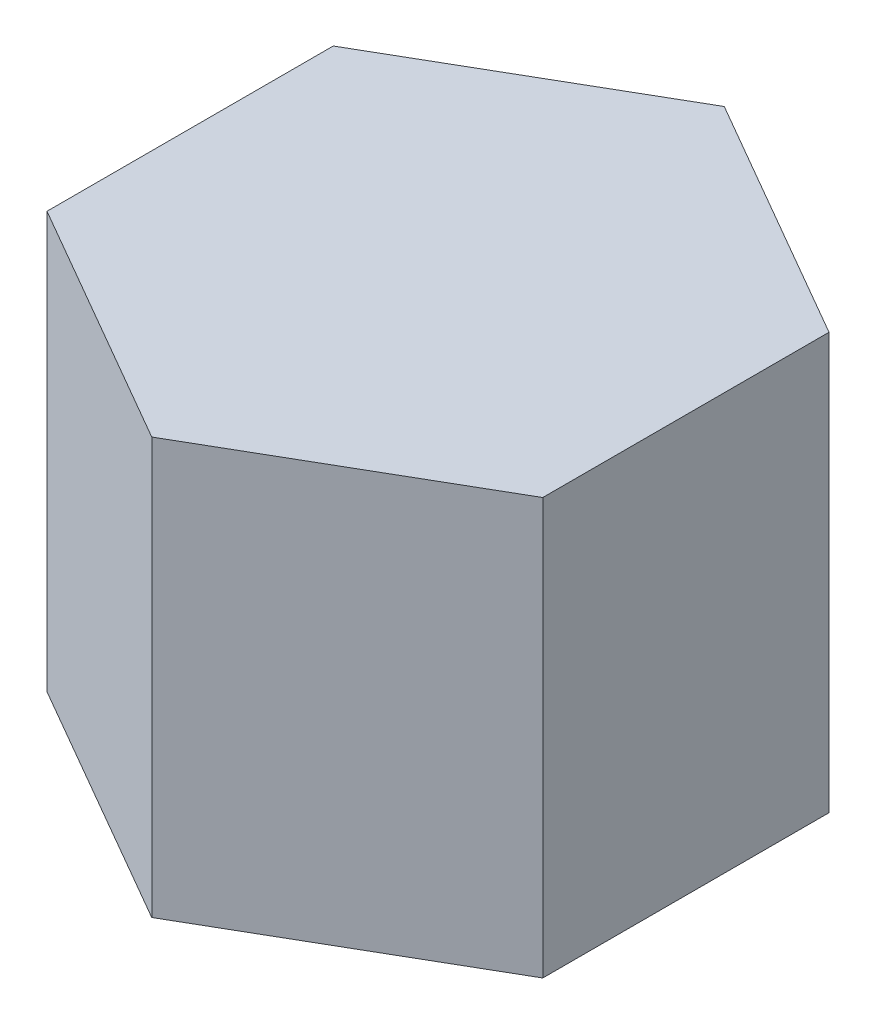
ISO-10303-21;
HEADER;
FILE_DESCRIPTION(('STEP AP214'),'2;1');
FILE_NAME('part.step','',(''),(''),'','','');
FILE_SCHEMA(('AUTOMOTIVE_DESIGN { 1 0 10303 214 1 1 1 1 }'));
ENDSEC;
DATA;
#1=APPLICATION_CONTEXT('core data for automotive mechanical design processes');
#2=APPLICATION_PROTOCOL_DEFINITION('international standard','automotive_design',2000,#1);
#3=PRODUCT_CONTEXT('',#1,'mechanical');
#4=PRODUCT('Part','Part','',(#3));
#5=PRODUCT_RELATED_PRODUCT_CATEGORY('part','',(#4));
#6=PRODUCT_DEFINITION_FORMATION('','',#4);
#7=PRODUCT_DEFINITION_CONTEXT('part definition',#1,'design');
#8=PRODUCT_DEFINITION('design','',#6,#7);
#9=PRODUCT_DEFINITION_SHAPE('','',#8);
#10=(LENGTH_UNIT() NAMED_UNIT(*) SI_UNIT(.MILLI.,.METRE.));
#11=(NAMED_UNIT(*) PLANE_ANGLE_UNIT() SI_UNIT($,.RADIAN.));
#12=(NAMED_UNIT(*) SI_UNIT($,.STERADIAN.) SOLID_ANGLE_UNIT());
#13=UNCERTAINTY_MEASURE_WITH_UNIT(LENGTH_MEASURE(1.E-05),#10,'distance_accuracy_value','');
#14=(GEOMETRIC_REPRESENTATION_CONTEXT(3) GLOBAL_UNCERTAINTY_ASSIGNED_CONTEXT((#13)) GLOBAL_UNIT_ASSIGNED_CONTEXT((#10,
#11,#12)) REPRESENTATION_CONTEXT('',''));
#15=CARTESIAN_POINT('',(0.,0.,0.));
#16=DIRECTION('',(0.,0.,1.));
#17=DIRECTION('',(1.,0.,0.));
#18=AXIS2_PLACEMENT_3D('',#15,#16,#17);
#19=CARTESIAN_POINT('',(210.339551417381,-147.556598747966,295.146072835632));
#20=DIRECTION('',(-0.500000000000062,0.,-0.866025403784403));
#21=DIRECTION('',(-0.866025403784403,0.,0.500000000000062));
#22=AXIS2_PLACEMENT_3D('',#19,#20,#21);
#23=PLANE('',#22);
#24=CARTESIAN_POINT('',(210.642660308706,-147.047793579175,294.971072835632));
#25=DIRECTION('',(-0.866025403784403,0.,0.500000000000062));
#26=VECTOR('',#25,1.);
#27=LINE('',#24,#26);
#28=CARTESIAN_POINT('',(210.642660308706,-147.047793579175,294.971072835632));
#29=VERTEX_POINT('',#28);
#30=CARTESIAN_POINT('',(210.339551417382,-147.047793579175,295.146072835632));
#31=VERTEX_POINT('',#30);
#32=EDGE_CURVE('E170',#29,#31,#27,.T.);
#33=ORIENTED_EDGE('',*,*,#32,.T.);
#34=CARTESIAN_POINT('',(210.339551417382,-147.556598747966,295.146072835632));
#35=DIRECTION('',(0.,1.,0.));
#36=VECTOR('',#35,1.);
#37=LINE('',#34,#36);
#38=CARTESIAN_POINT('',(210.339551417382,-147.556598747966,295.146072835632));
#39=VERTEX_POINT('',#38);
#40=EDGE_CURVE('E35',#39,#31,#37,.T.);
#41=ORIENTED_EDGE('',*,*,#40,.F.);
#42=CARTESIAN_POINT('',(210.642660308706,-147.556598747966,294.971072835632));
#43=DIRECTION('',(-0.866025403784403,0.,0.500000000000062));
#44=VECTOR('',#43,1.);
#45=LINE('',#42,#44);
#46=CARTESIAN_POINT('',(210.642660308706,-147.556598747966,294.971072835632));
#47=VERTEX_POINT('',#46);
#48=EDGE_CURVE('E159',#47,#39,#45,.T.);
#49=ORIENTED_EDGE('',*,*,#48,.F.);
#50=CARTESIAN_POINT('',(210.642660308706,-147.556598747966,294.971072835632));
#51=DIRECTION('',(0.,1.,0.));
#52=VECTOR('',#51,1.);
#53=LINE('',#50,#52);
#54=EDGE_CURVE('E10',#47,#29,#53,.T.);
#55=ORIENTED_EDGE('',*,*,#54,.T.);
#56=EDGE_LOOP('',(#33,#41,#49,#55));
#57=FACE_BOUND('',#56,.T.);
#58=ADVANCED_FACE('F16',(#57),#23,.F.);
#59=CARTESIAN_POINT('',(210.642660308706,-147.556598747966,291.594471220494));
#60=DIRECTION('',(-1.,0.,0.));
#61=DIRECTION('',(0.,-1.,0.));
#62=AXIS2_PLACEMENT_3D('',#59,#60,#61);
#63=PLANE('',#62);
#64=CARTESIAN_POINT('',(210.642660308706,-147.047793579175,294.621072835632));
#65=DIRECTION('',(0.,0.,1.));
#66=VECTOR('',#65,1.);
#67=LINE('',#64,#66);
#68=CARTESIAN_POINT('',(210.642660308706,-147.047793579175,294.621072835632));
#69=VERTEX_POINT('',#68);
#70=EDGE_CURVE('E167',#69,#29,#67,.T.);
#71=ORIENTED_EDGE('',*,*,#70,.T.);
#72=ORIENTED_EDGE('',*,*,#54,.F.);
#73=CARTESIAN_POINT('',(210.642660308706,-147.556598747966,294.621072835632));
#74=DIRECTION('',(0.,0.,1.));
#75=VECTOR('',#74,1.);
#76=LINE('',#73,#75);
#77=CARTESIAN_POINT('',(210.642660308706,-147.556598747966,294.621072835632));
#78=VERTEX_POINT('',#77);
#79=EDGE_CURVE('E156',#78,#47,#76,.T.);
#80=ORIENTED_EDGE('',*,*,#79,.F.);
#81=CARTESIAN_POINT('',(210.642660308706,-147.556598747966,294.621072835632));
#82=DIRECTION('',(0.,1.,0.));
#83=VECTOR('',#82,1.);
#84=LINE('',#81,#83);
#85=EDGE_CURVE('E27',#78,#69,#84,.T.);
#86=ORIENTED_EDGE('',*,*,#85,.T.);
#87=EDGE_LOOP('',(#71,#72,#80,#86));
#88=FACE_BOUND('',#87,.T.);
#89=ADVANCED_FACE('F189',(#88),#63,.F.);
#90=CARTESIAN_POINT('',(210.642660308706,-147.556598747966,294.621072835632));
#91=DIRECTION('',(-0.500000000000096,0.,0.866025403784383));
#92=DIRECTION('',(0.866025403784383,0.,0.500000000000096));
#93=AXIS2_PLACEMENT_3D('',#90,#91,#92);
#94=PLANE('',#93);
#95=CARTESIAN_POINT('',(210.339551417382,-147.047793579175,294.446072835632));
#96=DIRECTION('',(0.866025403784383,0.,0.500000000000096));
#97=VECTOR('',#96,1.);
#98=LINE('',#95,#97);
#99=CARTESIAN_POINT('',(210.339551417382,-147.047793579175,294.446072835632));
#100=VERTEX_POINT('',#99);
#101=EDGE_CURVE('E163',#100,#69,#98,.T.);
#102=ORIENTED_EDGE('',*,*,#101,.T.);
#103=ORIENTED_EDGE('',*,*,#85,.F.);
#104=CARTESIAN_POINT('',(210.339551417382,-147.556598747966,294.446072835632));
#105=DIRECTION('',(0.866025403784383,0.,0.500000000000096));
#106=VECTOR('',#105,1.);
#107=LINE('',#104,#106);
#108=CARTESIAN_POINT('',(210.339551417382,-147.556598747966,294.446072835632));
#109=VERTEX_POINT('',#108);
#110=EDGE_CURVE('E106',#109,#78,#107,.T.);
#111=ORIENTED_EDGE('',*,*,#110,.F.);
#112=CARTESIAN_POINT('',(210.339551417382,-147.556598747966,294.446072835632));
#113=DIRECTION('',(0.,1.,0.));
#114=VECTOR('',#113,1.);
#115=LINE('',#112,#114);
#116=EDGE_CURVE('E94',#109,#100,#115,.T.);
#117=ORIENTED_EDGE('',*,*,#116,.T.);
#118=EDGE_LOOP('',(#102,#103,#111,#117));
#119=FACE_BOUND('',#118,.T.);
#120=ADVANCED_FACE('F198',(#119),#94,.F.);
#121=CARTESIAN_POINT('',(210.339551417382,-147.556598747966,294.446072835632));
#122=DIRECTION('',(0.499999999999978,0.,0.866025403784452));
#123=DIRECTION('',(0.866025403784452,0.,-0.499999999999978));
#124=AXIS2_PLACEMENT_3D('',#121,#122,#123);
#125=PLANE('',#124);
#126=CARTESIAN_POINT('',(210.036442526057,-147.047793579175,294.621072835632));
#127=DIRECTION('',(0.866025403784452,0.,-0.499999999999978));
#128=VECTOR('',#127,1.);
#129=LINE('',#126,#128);
#130=CARTESIAN_POINT('',(210.036442526057,-147.047793579175,294.621072835632));
#131=VERTEX_POINT('',#130);
#132=EDGE_CURVE('E162',#131,#100,#129,.T.);
#133=ORIENTED_EDGE('',*,*,#132,.T.);
#134=ORIENTED_EDGE('',*,*,#116,.F.);
#135=CARTESIAN_POINT('',(210.036442526057,-147.556598747966,294.621072835632));
#136=DIRECTION('',(0.866025403784452,0.,-0.499999999999978));
#137=VECTOR('',#136,1.);
#138=LINE('',#135,#137);
#139=CARTESIAN_POINT('',(210.036442526057,-147.556598747966,294.621072835632));
#140=VERTEX_POINT('',#139);
#141=EDGE_CURVE('E98',#140,#109,#138,.T.);
#142=ORIENTED_EDGE('',*,*,#141,.F.);
#143=CARTESIAN_POINT('',(210.036442526057,-147.556598747966,294.621072835632));
#144=DIRECTION('',(0.,1.,0.));
#145=VECTOR('',#144,1.);
#146=LINE('',#143,#145);
#147=EDGE_CURVE('E79',#140,#131,#146,.T.);
#148=ORIENTED_EDGE('',*,*,#147,.T.);
#149=EDGE_LOOP('',(#133,#134,#142,#148));
#150=FACE_BOUND('',#149,.T.);
#151=ADVANCED_FACE('F100',(#150),#125,.F.);
#152=CARTESIAN_POINT('',(210.036442526057,-147.556598747966,291.594471220494));
#153=DIRECTION('',(1.,0.,0.));
#154=DIRECTION('',(0.,1.,0.));
#155=AXIS2_PLACEMENT_3D('',#152,#153,#154);
#156=PLANE('',#155);
#157=CARTESIAN_POINT('',(210.036442526057,-147.047793579175,294.971072835632));
#158=DIRECTION('',(0.,0.,-1.));
#159=VECTOR('',#158,1.);
#160=LINE('',#157,#159);
#161=CARTESIAN_POINT('',(210.036442526057,-147.047793579175,294.971072835632));
#162=VERTEX_POINT('',#161);
#163=EDGE_CURVE('E88',#162,#131,#160,.T.);
#164=ORIENTED_EDGE('',*,*,#163,.T.);
#165=ORIENTED_EDGE('',*,*,#147,.F.);
#166=CARTESIAN_POINT('',(210.036442526057,-147.556598747966,294.971072835632));
#167=DIRECTION('',(0.,0.,-1.));
#168=VECTOR('',#167,1.);
#169=LINE('',#166,#168);
#170=CARTESIAN_POINT('',(210.036442526057,-147.556598747966,294.971072835632));
#171=VERTEX_POINT('',#170);
#172=EDGE_CURVE('E84',#171,#140,#169,.T.);
#173=ORIENTED_EDGE('',*,*,#172,.F.);
#174=CARTESIAN_POINT('',(210.036442526057,-147.556598747966,294.971072835632));
#175=DIRECTION('',(0.,1.,0.));
#176=VECTOR('',#175,1.);
#177=LINE('',#174,#176);
#178=EDGE_CURVE('E58',#171,#162,#177,.T.);
#179=ORIENTED_EDGE('',*,*,#178,.T.);
#180=EDGE_LOOP('',(#164,#165,#173,#179));
#181=FACE_BOUND('',#180,.T.);
#182=ADVANCED_FACE('F82',(#181),#156,.F.);
#183=CARTESIAN_POINT('',(210.036442526057,-147.556598747966,294.971072835632));
#184=DIRECTION('',(0.500000000000096,0.,-0.866025403784383));
#185=DIRECTION('',(-0.866025403784383,0.,-0.500000000000096));
#186=AXIS2_PLACEMENT_3D('',#183,#184,#185);
#187=PLANE('',#186);
#188=CARTESIAN_POINT('',(210.339551417382,-147.047793579175,295.146072835632));
#189=DIRECTION('',(-0.866025403784383,0.,-0.500000000000096));
#190=VECTOR('',#189,1.);
#191=LINE('',#188,#190);
#192=EDGE_CURVE('E160',#31,#162,#191,.T.);
#193=ORIENTED_EDGE('',*,*,#192,.T.);
#194=ORIENTED_EDGE('',*,*,#178,.F.);
#195=CARTESIAN_POINT('',(210.339551417382,-147.556598747966,295.146072835632));
#196=DIRECTION('',(-0.866025403784383,0.,-0.500000000000096));
#197=VECTOR('',#196,1.);
#198=LINE('',#195,#197);
#199=EDGE_CURVE('E112',#39,#171,#198,.T.);
#200=ORIENTED_EDGE('',*,*,#199,.F.);
#201=ORIENTED_EDGE('',*,*,#40,.T.);
#202=EDGE_LOOP('',(#193,#194,#200,#201));
#203=FACE_BOUND('',#202,.T.);
#204=ADVANCED_FACE('F131',(#203),#187,.F.);
#205=CARTESIAN_POINT('',(206.491105863044,-147.556598747966,291.594471220494));
#206=DIRECTION('',(0.,1.,0.));
#207=DIRECTION('',(-1.,0.,0.));
#208=AXIS2_PLACEMENT_3D('',#205,#206,#207);
#209=PLANE('',#208);
#210=ORIENTED_EDGE('',*,*,#48,.T.);
#211=ORIENTED_EDGE('',*,*,#199,.T.);
#212=ORIENTED_EDGE('',*,*,#172,.T.);
#213=ORIENTED_EDGE('',*,*,#141,.T.);
#214=ORIENTED_EDGE('',*,*,#110,.T.);
#215=ORIENTED_EDGE('',*,*,#79,.T.);
#216=EDGE_LOOP('',(#210,#211,#212,#213,#214,#215));
#217=FACE_BOUND('',#216,.T.);
#218=ADVANCED_FACE('F111',(#217),#209,.F.);
#219=CARTESIAN_POINT('',(206.491105863044,-147.047793579175,291.594471220494));
#220=DIRECTION('',(0.,1.,0.));
#221=DIRECTION('',(-1.,0.,0.));
#222=AXIS2_PLACEMENT_3D('',#219,#220,#221);
#223=PLANE('',#222);
#224=ORIENTED_EDGE('',*,*,#32,.F.);
#225=ORIENTED_EDGE('',*,*,#70,.F.);
#226=ORIENTED_EDGE('',*,*,#101,.F.);
#227=ORIENTED_EDGE('',*,*,#132,.F.);
#228=ORIENTED_EDGE('',*,*,#163,.F.);
#229=ORIENTED_EDGE('',*,*,#192,.F.);
#230=EDGE_LOOP('',(#224,#225,#226,#227,#228,#229));
#231=FACE_BOUND('',#230,.T.);
#232=ADVANCED_FACE('F130',(#231),#223,.T.);
#233=CLOSED_SHELL('',(#58,#89,#120,#151,#182,#204,#218,#232));
#234=MANIFOLD_SOLID_BREP('B1',#233);
#235=ADVANCED_BREP_SHAPE_REPRESENTATION('',(#18,#234),#14);
#236=SHAPE_DEFINITION_REPRESENTATION(#9,#235);
ENDSEC;
END-ISO-10303-21;
